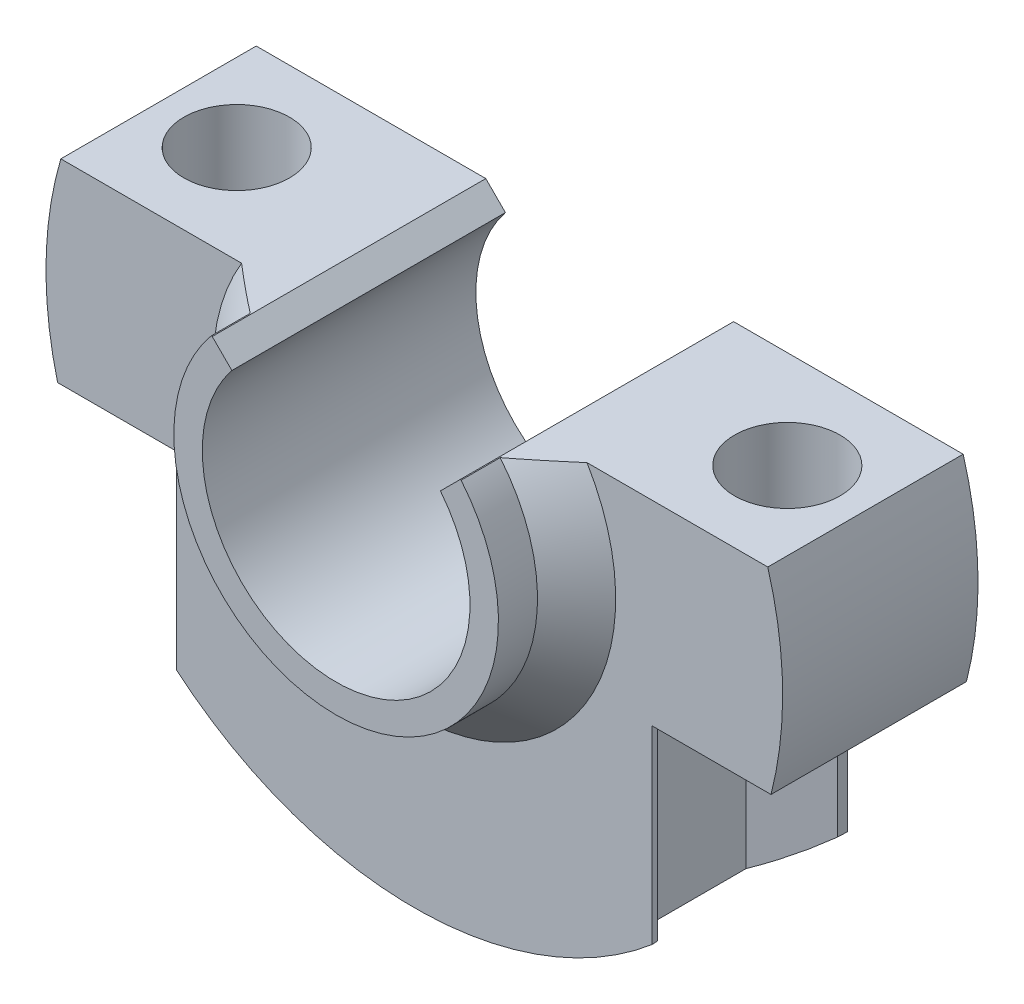
ISO-10303-21;
HEADER;
FILE_DESCRIPTION(('STEP AP214'),'2;1');
FILE_NAME('part.step','',(''),(''),'','','');
FILE_SCHEMA(('AUTOMOTIVE_DESIGN { 1 0 10303 214 1 1 1 1 }'));
ENDSEC;
DATA;
#1=APPLICATION_CONTEXT('core data for automotive mechanical design processes');
#2=APPLICATION_PROTOCOL_DEFINITION('international standard','automotive_design',2000,#1);
#3=PRODUCT_CONTEXT('',#1,'mechanical');
#4=PRODUCT('Part','Part','',(#3));
#5=PRODUCT_RELATED_PRODUCT_CATEGORY('part','',(#4));
#6=PRODUCT_DEFINITION_FORMATION('','',#4);
#7=PRODUCT_DEFINITION_CONTEXT('part definition',#1,'design');
#8=PRODUCT_DEFINITION('design','',#6,#7);
#9=PRODUCT_DEFINITION_SHAPE('','',#8);
#10=(LENGTH_UNIT() NAMED_UNIT(*) SI_UNIT(.MILLI.,.METRE.));
#11=(NAMED_UNIT(*) PLANE_ANGLE_UNIT() SI_UNIT($,.RADIAN.));
#12=(NAMED_UNIT(*) SI_UNIT($,.STERADIAN.) SOLID_ANGLE_UNIT());
#13=UNCERTAINTY_MEASURE_WITH_UNIT(LENGTH_MEASURE(1.E-05),#10,'distance_accuracy_value','');
#14=(GEOMETRIC_REPRESENTATION_CONTEXT(3) GLOBAL_UNCERTAINTY_ASSIGNED_CONTEXT((#13)) GLOBAL_UNIT_ASSIGNED_CONTEXT((#10,
#11,#12)) REPRESENTATION_CONTEXT('',''));
#15=CARTESIAN_POINT('',(0.,0.,0.));
#16=DIRECTION('',(0.,0.,1.));
#17=DIRECTION('',(1.,0.,0.));
#18=AXIS2_PLACEMENT_3D('',#15,#16,#17);
#19=CARTESIAN_POINT('',(0.,0.,2.5));
#20=DIRECTION('',(0.,0.,-1.));
#21=DIRECTION('',(-1.,0.,0.));
#22=AXIS2_PLACEMENT_3D('',#19,#20,#21);
#23=CYLINDRICAL_SURFACE('',#22,9.425);
#24=DIRECTION('',(0.,0.,-1.));
#25=VECTOR('',#24,1.);
#26=CARTESIAN_POINT('',(9.12723336786997,-2.35036934298441,2.5));
#27=LINE('',#26,#25);
#28=CARTESIAN_POINT('',(9.12723336786997,-2.35036934298441,-2.5));
#29=VERTEX_POINT('',#28);
#30=CARTESIAN_POINT('',(9.12723336786997,-2.35036934298441,2.5));
#31=VERTEX_POINT('',#30);
#32=EDGE_CURVE('E263',#29,#31,#27,.F.);
#33=ORIENTED_EDGE('',*,*,#32,.F.);
#34=CARTESIAN_POINT('',(0.,0.,-2.5));
#35=DIRECTION('',(0.,0.,1.));
#36=DIRECTION('',(1.,0.,0.));
#37=AXIS2_PLACEMENT_3D('',#34,#35,#36);
#38=CIRCLE('',#37,9.425);
#39=CARTESIAN_POINT('',(9.04489261303876,2.64963065701559,-2.5));
#40=VERTEX_POINT('',#39);
#41=EDGE_CURVE('E309',#29,#40,#38,.T.);
#42=ORIENTED_EDGE('',*,*,#41,.T.);
#43=DIRECTION('',(0.,0.,-1.));
#44=VECTOR('',#43,1.);
#45=CARTESIAN_POINT('',(9.04489261303876,2.64963065701559,2.5));
#46=LINE('',#45,#44);
#47=CARTESIAN_POINT('',(9.04489261303876,2.64963065701559,2.5));
#48=VERTEX_POINT('',#47);
#49=EDGE_CURVE('E307',#48,#40,#46,.T.);
#50=ORIENTED_EDGE('',*,*,#49,.F.);
#51=CARTESIAN_POINT('',(0.,0.,2.5));
#52=DIRECTION('',(0.,0.,1.));
#53=DIRECTION('',(1.,0.,0.));
#54=AXIS2_PLACEMENT_3D('',#51,#52,#53);
#55=CIRCLE('',#54,9.425);
#56=EDGE_CURVE('E299',#31,#48,#55,.T.);
#57=ORIENTED_EDGE('',*,*,#56,.F.);
#58=EDGE_LOOP('',(#33,#42,#50,#57));
#59=FACE_BOUND('',#58,.T.);
#60=ADVANCED_FACE('F47',(#59),#23,.T.);
#61=DIRECTION('',(0.,0.,-1.));
#62=VECTOR('',#61,1.);
#63=CARTESIAN_POINT('',(-9.12723336786997,-2.35036934298441,2.5));
#64=LINE('',#63,#62);
#65=CARTESIAN_POINT('',(-9.12723336786997,-2.35036934298441,2.5));
#66=VERTEX_POINT('',#65);
#67=CARTESIAN_POINT('',(-9.12723336786997,-2.35036934298441,-2.5));
#68=VERTEX_POINT('',#67);
#69=EDGE_CURVE('E256',#66,#68,#64,.T.);
#70=ORIENTED_EDGE('',*,*,#69,.F.);
#71=CARTESIAN_POINT('',(-9.04489261303876,2.64963065701559,2.5));
#72=VERTEX_POINT('',#71);
#73=EDGE_CURVE('E301',#72,#66,#55,.T.);
#74=ORIENTED_EDGE('',*,*,#73,.F.);
#75=DIRECTION('',(0.,0.,-1.));
#76=VECTOR('',#75,1.);
#77=CARTESIAN_POINT('',(-9.04489261303876,2.64963065701559,2.5));
#78=LINE('',#77,#76);
#79=CARTESIAN_POINT('',(-9.04489261303876,2.64963065701559,-2.5));
#80=VERTEX_POINT('',#79);
#81=EDGE_CURVE('E321',#72,#80,#78,.T.);
#82=ORIENTED_EDGE('',*,*,#81,.T.);
#83=EDGE_CURVE('E310',#80,#68,#38,.T.);
#84=ORIENTED_EDGE('',*,*,#83,.T.);
#85=EDGE_LOOP('',(#70,#74,#82,#84));
#86=FACE_BOUND('',#85,.T.);
#87=ADVANCED_FACE('F407',(#86),#23,.T.);
#88=CARTESIAN_POINT('',(7.04489261303876,2.64963065701559,0.));
#89=DIRECTION('',(0.,1.,0.));
#90=DIRECTION('',(0.,0.,1.));
#91=AXIS2_PLACEMENT_3D('',#88,#89,#90);
#92=CYLINDRICAL_SURFACE('',#91,1.34999999999999);
#93=CARTESIAN_POINT('',(7.04489261303876,2.64963065701559,0.));
#94=DIRECTION('',(0.,1.,0.));
#95=DIRECTION('',(0.,0.,1.));
#96=AXIS2_PLACEMENT_3D('',#93,#94,#95);
#97=CIRCLE('',#96,1.34999999999999);
#98=CARTESIAN_POINT('',(7.04489261303876,2.64963065701559,1.34999999999999));
#99=VERTEX_POINT('',#98);
#100=EDGE_CURVE('E279',#99,#99,#97,.T.);
#101=ORIENTED_EDGE('',*,*,#100,.T.);
#102=EDGE_LOOP('',(#101));
#103=FACE_BOUND('',#102,.T.);
#104=CARTESIAN_POINT('',(7.04489261303876,-2.35036934298441,0.));
#105=DIRECTION('',(0.,-1.,0.));
#106=DIRECTION('',(1.,0.,0.));
#107=AXIS2_PLACEMENT_3D('',#104,#105,#106);
#108=CIRCLE('',#107,1.34999999999999);
#109=CARTESIAN_POINT('',(8.39489261303875,-2.35036934298441,0.));
#110=VERTEX_POINT('',#109);
#111=EDGE_CURVE('E260',#110,#110,#108,.F.);
#112=ORIENTED_EDGE('',*,*,#111,.F.);
#113=EDGE_LOOP('',(#112));
#114=FACE_BOUND('',#113,.T.);
#115=ADVANCED_FACE('F465',(#103,#114),#92,.F.);
#116=CARTESIAN_POINT('',(-7.04489261303876,2.64963065701559,0.));
#117=DIRECTION('',(0.,1.,0.));
#118=DIRECTION('',(0.,0.,1.));
#119=AXIS2_PLACEMENT_3D('',#116,#117,#118);
#120=CYLINDRICAL_SURFACE('',#119,1.34999999999999);
#121=CARTESIAN_POINT('',(-7.04489261303876,2.64963065701559,0.));
#122=DIRECTION('',(0.,1.,0.));
#123=DIRECTION('',(0.,0.,1.));
#124=AXIS2_PLACEMENT_3D('',#121,#122,#123);
#125=CIRCLE('',#124,1.34999999999999);
#126=CARTESIAN_POINT('',(-7.04489261303876,2.64963065701559,1.34999999999999));
#127=VERTEX_POINT('',#126);
#128=EDGE_CURVE('E276',#127,#127,#125,.T.);
#129=ORIENTED_EDGE('',*,*,#128,.T.);
#130=EDGE_LOOP('',(#129));
#131=FACE_BOUND('',#130,.T.);
#132=CARTESIAN_POINT('',(-7.04489261303876,-2.35036934298441,0.));
#133=DIRECTION('',(0.,-1.,0.));
#134=DIRECTION('',(1.,0.,0.));
#135=AXIS2_PLACEMENT_3D('',#132,#133,#134);
#136=CIRCLE('',#135,1.34999999999999);
#137=CARTESIAN_POINT('',(-5.69489261303877,-2.35036934298441,0.));
#138=VERTEX_POINT('',#137);
#139=EDGE_CURVE('E235',#138,#138,#136,.F.);
#140=ORIENTED_EDGE('',*,*,#139,.F.);
#141=EDGE_LOOP('',(#140));
#142=FACE_BOUND('',#141,.T.);
#143=ADVANCED_FACE('F411',(#131,#142),#120,.F.);
#144=CARTESIAN_POINT('',(0.,2.64963065701559,2.5));
#145=DIRECTION('',(0.,-1.,0.));
#146=DIRECTION('',(1.,0.,0.));
#147=AXIS2_PLACEMENT_3D('',#144,#145,#146);
#148=PLANE('',#147);
#149=ORIENTED_EDGE('',*,*,#128,.F.);
#150=EDGE_LOOP('',(#149));
#151=FACE_BOUND('',#150,.T.);
#152=DIRECTION('',(-1.,0.,0.));
#153=VECTOR('',#152,1.);
#154=CARTESIAN_POINT('',(0.,2.64963065701559,4.5));
#155=LINE('',#154,#153);
#156=CARTESIAN_POINT('',(-3.17027242101151,2.64963065701559,4.5));
#157=VERTEX_POINT('',#156);
#158=CARTESIAN_POINT('',(-3.19781734803649,2.64963065701559,4.5));
#159=VERTEX_POINT('',#158);
#160=EDGE_CURVE('E282',#157,#159,#155,.T.);
#161=ORIENTED_EDGE('',*,*,#160,.F.);
#162=DIRECTION('',(0.,0.,-1.));
#163=VECTOR('',#162,1.);
#164=CARTESIAN_POINT('',(-3.17027242101151,2.64963065701559,-2.5));
#165=LINE('',#164,#163);
#166=CARTESIAN_POINT('',(-3.17027242101151,2.64963065701559,-2.5));
#167=VERTEX_POINT('',#166);
#168=EDGE_CURVE('E324',#157,#167,#165,.T.);
#169=ORIENTED_EDGE('',*,*,#168,.T.);
#170=DIRECTION('',(-1.,0.,0.));
#171=VECTOR('',#170,1.);
#172=CARTESIAN_POINT('',(0.,2.64963065701559,-2.5));
#173=LINE('',#172,#171);
#174=EDGE_CURVE('E296',#167,#80,#173,.T.);
#175=ORIENTED_EDGE('',*,*,#174,.T.);
#176=ORIENTED_EDGE('',*,*,#81,.F.);
#177=DIRECTION('',(-1.,0.,0.));
#178=VECTOR('',#177,1.);
#179=CARTESIAN_POINT('',(0.,2.64963065701559,2.5));
#180=LINE('',#179,#178);
#181=CARTESIAN_POINT('',(-4.41948365665076,2.64963065701559,2.5));
#182=VERTEX_POINT('',#181);
#183=EDGE_CURVE('E297',#182,#72,#180,.T.);
#184=ORIENTED_EDGE('',*,*,#183,.F.);
#185=CARTESIAN_POINT('',(-4.41948365665076,2.64963065701559,2.5));
#186=CARTESIAN_POINT('',(-4.31959768884231,2.64963065701559,2.58565684513443));
#187=CARTESIAN_POINT('',(-4.21934243178174,2.64963065701559,2.67088694132072));
#188=CARTESIAN_POINT('',(-4.01795020571289,2.64963065701559,2.84026347434788));
#189=CARTESIAN_POINT('',(-3.91681338856895,2.64963065701559,2.92441009188328));
#190=CARTESIAN_POINT('',(-3.71347592329484,2.64963065701559,3.09142298373748));
#191=CARTESIAN_POINT('',(-3.61127521962635,2.64963065701559,3.17428919064802));
#192=CARTESIAN_POINT('',(-3.40557353831562,2.64963065701559,3.33842619788159));
#193=CARTESIAN_POINT('',(-3.30207234305039,2.64963065701559,3.41969672519358));
#194=CARTESIAN_POINT('',(-3.19781734803649,2.64963065701559,3.50000000000001));
#195=B_SPLINE_CURVE_WITH_KNOTS('',3,(#185,#186,#187,#188,#189,#190,#191,#192,#193,#194),
.UNSPECIFIED.,.F.,.F.,(4,2,2,2,4),(0.,0.394753807508847,0.789440905232861,1.18414871126867,
1.57892347105236),.UNSPECIFIED.);
#196=CARTESIAN_POINT('',(-3.19781734803649,2.64963065701559,3.50000000000001));
#197=VERTEX_POINT('',#196);
#198=EDGE_CURVE('E12',#182,#197,#195,.T.);
#199=ORIENTED_EDGE('',*,*,#198,.T.);
#200=DIRECTION('',(0.,0.,-1.));
#201=VECTOR('',#200,1.);
#202=CARTESIAN_POINT('',(-3.19781734803649,2.64963065701559,4.5));
#203=LINE('',#202,#201);
#204=EDGE_CURVE('E293',#159,#197,#203,.T.);
#205=ORIENTED_EDGE('',*,*,#204,.F.);
#206=EDGE_LOOP('',(#161,#169,#175,#176,#184,#199,#205));
#207=FACE_BOUND('',#206,.T.);
#208=ADVANCED_FACE('F405',(#151,#207),#148,.F.);
#209=CARTESIAN_POINT('',(-6.08219930893342,-7.19982475942365,-2.5));
#210=VERTEX_POINT('',#209);
#211=CARTESIAN_POINT('',(6.0821993089334,-7.19982475942367,-2.5));
#212=VERTEX_POINT('',#211);
#213=EDGE_CURVE('E314',#210,#212,#38,.T.);
#214=ORIENTED_EDGE('',*,*,#213,.T.);
#215=CARTESIAN_POINT('',(0.,0.,20.1990768426996));
#216=DIRECTION('',(-0.965925826289068,0.,-0.258819045102522));
#217=DIRECTION('',(0.258819045102522,0.,-0.965925826289068));
#218=AXIS2_PLACEMENT_3D('',#215,#216,#217);
#219=ELLIPSE('',#218,36.4154036510976,9.425);
#220=CARTESIAN_POINT('',(6.02860947044718,-7.24475623142936,-2.3));
#221=VERTEX_POINT('',#220);
#222=EDGE_CURVE('E376',#212,#221,#219,.T.);
#223=ORIENTED_EDGE('',*,*,#222,.T.);
#224=CARTESIAN_POINT('',(0.,0.,1.1806193006018));
#225=DIRECTION('',(-0.5,0.,-0.866025403784439));
#226=DIRECTION('',(0.866025403784439,0.,-0.5));
#227=AXIS2_PLACEMENT_3D('',#224,#225,#226);
#228=ELLIPSE('',#227,10.8830525742244,9.425);
#229=CARTESIAN_POINT('',(4.54489261303876,-8.25678969914734,-1.44337567297407));
#230=VERTEX_POINT('',#229);
#231=EDGE_CURVE('E271',#221,#230,#228,.T.);
#232=ORIENTED_EDGE('',*,*,#231,.T.);
#233=DIRECTION('',(0.,0.,-1.));
#234=VECTOR('',#233,1.);
#235=CARTESIAN_POINT('',(4.54489261303876,-8.25678969914735,2.5));
#236=LINE('',#235,#234);
#237=CARTESIAN_POINT('',(4.54489261303876,-8.25678969914734,1.44337567297406));
#238=VERTEX_POINT('',#237);
#239=EDGE_CURVE('E348',#230,#238,#236,.F.);
#240=ORIENTED_EDGE('',*,*,#239,.T.);
#241=CARTESIAN_POINT('',(0.,0.,-1.1806193006018));
#242=DIRECTION('',(-0.5,0.,0.866025403784439));
#243=DIRECTION('',(-0.866025403784439,0.,-0.5));
#244=AXIS2_PLACEMENT_3D('',#241,#242,#243);
#245=ELLIPSE('',#244,10.8830525742244,9.425);
#246=CARTESIAN_POINT('',(6.02860947044718,-7.24475623142936,2.3));
#247=VERTEX_POINT('',#246);
#248=EDGE_CURVE('E228',#238,#247,#245,.T.);
#249=ORIENTED_EDGE('',*,*,#248,.T.);
#250=CARTESIAN_POINT('',(0.,0.,-20.1990768426996));
#251=DIRECTION('',(0.965925826289068,0.,-0.258819045102523));
#252=DIRECTION('',(-0.258819045102523,0.,-0.965925826289068));
#253=AXIS2_PLACEMENT_3D('',#250,#251,#252);
#254=ELLIPSE('',#253,36.4154036510976,9.425);
#255=CARTESIAN_POINT('',(6.08219930893341,-7.19982475942366,2.5));
#256=VERTEX_POINT('',#255);
#257=EDGE_CURVE('E358',#247,#256,#254,.F.);
#258=ORIENTED_EDGE('',*,*,#257,.T.);
#259=CARTESIAN_POINT('',(-6.0821993089334,-7.19982475942367,2.5));
#260=VERTEX_POINT('',#259);
#261=EDGE_CURVE('E305',#260,#256,#55,.T.);
#262=ORIENTED_EDGE('',*,*,#261,.F.);
#263=CARTESIAN_POINT('',(0.,0.,-20.1990768426992));
#264=DIRECTION('',(-0.965925826289067,0.,-0.258819045102526));
#265=DIRECTION('',(0.258819045102526,0.,-0.965925826289067));
#266=AXIS2_PLACEMENT_3D('',#263,#264,#265);
#267=ELLIPSE('',#266,36.4154036510971,9.425);
#268=CARTESIAN_POINT('',(-6.02860947044717,-7.24475623142937,2.3));
#269=VERTEX_POINT('',#268);
#270=EDGE_CURVE('E360',#260,#269,#267,.F.);
#271=ORIENTED_EDGE('',*,*,#270,.T.);
#272=CARTESIAN_POINT('',(0.,0.,-1.18061930060181));
#273=DIRECTION('',(0.5,0.,0.866025403784439));
#274=DIRECTION('',(0.866025403784439,0.,-0.5));
#275=AXIS2_PLACEMENT_3D('',#272,#273,#274);
#276=ELLIPSE('',#275,10.8830525742244,9.425);
#277=CARTESIAN_POINT('',(-4.54489261303876,-8.25678969914734,1.44337567297406));
#278=VERTEX_POINT('',#277);
#279=EDGE_CURVE('E273',#269,#278,#276,.T.);
#280=ORIENTED_EDGE('',*,*,#279,.T.);
#281=DIRECTION('',(0.,0.,-1.));
#282=VECTOR('',#281,1.);
#283=CARTESIAN_POINT('',(-4.54489261303876,-8.25678969914734,2.5));
#284=LINE('',#283,#282);
#285=CARTESIAN_POINT('',(-4.54489261303876,-8.25678969914734,-1.44337567297406));
#286=VERTEX_POINT('',#285);
#287=EDGE_CURVE('E342',#278,#286,#284,.T.);
#288=ORIENTED_EDGE('',*,*,#287,.T.);
#289=CARTESIAN_POINT('',(0.,0.,1.18061930060181));
#290=DIRECTION('',(0.5,0.,-0.866025403784439));
#291=DIRECTION('',(-0.866025403784439,0.,-0.5));
#292=AXIS2_PLACEMENT_3D('',#289,#290,#291);
#293=ELLIPSE('',#292,10.8830525742244,9.425);
#294=CARTESIAN_POINT('',(-6.02860947044719,-7.24475623142935,-2.30000000000001));
#295=VERTEX_POINT('',#294);
#296=EDGE_CURVE('E268',#286,#295,#293,.T.);
#297=ORIENTED_EDGE('',*,*,#296,.T.);
#298=CARTESIAN_POINT('',(0.,0.,20.1990768426992));
#299=DIRECTION('',(0.965925826289067,0.,-0.258819045102527));
#300=DIRECTION('',(-0.258819045102527,0.,-0.965925826289067));
#301=AXIS2_PLACEMENT_3D('',#298,#299,#300);
#302=ELLIPSE('',#301,36.415403651097,9.425);
#303=EDGE_CURVE('E374',#295,#210,#302,.T.);
#304=ORIENTED_EDGE('',*,*,#303,.T.);
#305=EDGE_LOOP('',(#214,#223,#232,#240,#249,#258,#262,#271,#280,#288,#297,#304));
#306=FACE_BOUND('',#305,.T.);
#307=ADVANCED_FACE('F401',(#306),#23,.T.);
#308=CARTESIAN_POINT('',(0.,2.64963065701559,2.5));
#309=DIRECTION('',(0.,1.,0.));
#310=DIRECTION('',(-1.,0.,0.));
#311=AXIS2_PLACEMENT_3D('',#308,#309,#310);
#312=PLANE('',#311);
#313=ORIENTED_EDGE('',*,*,#100,.F.);
#314=EDGE_LOOP('',(#313));
#315=FACE_BOUND('',#314,.T.);
#316=DIRECTION('',(1.,0.,0.));
#317=VECTOR('',#316,1.);
#318=CARTESIAN_POINT('',(0.,2.64963065701559,-2.5));
#319=LINE('',#318,#317);
#320=CARTESIAN_POINT('',(3.17027242101151,2.64963065701559,-2.5));
#321=VERTEX_POINT('',#320);
#322=EDGE_CURVE('E313',#321,#40,#319,.T.);
#323=ORIENTED_EDGE('',*,*,#322,.F.);
#324=DIRECTION('',(0.,0.,1.));
#325=VECTOR('',#324,1.);
#326=CARTESIAN_POINT('',(3.17027242101151,2.64963065701559,2.5));
#327=LINE('',#326,#325);
#328=CARTESIAN_POINT('',(3.17027242101151,2.64963065701559,4.5));
#329=VERTEX_POINT('',#328);
#330=EDGE_CURVE('E339',#321,#329,#327,.T.);
#331=ORIENTED_EDGE('',*,*,#330,.T.);
#332=DIRECTION('',(-1.,0.,0.));
#333=VECTOR('',#332,1.);
#334=CARTESIAN_POINT('',(0.,2.64963065701559,4.5));
#335=LINE('',#334,#333);
#336=CARTESIAN_POINT('',(3.19781734803649,2.64963065701559,4.5));
#337=VERTEX_POINT('',#336);
#338=EDGE_CURVE('E286',#337,#329,#335,.T.);
#339=ORIENTED_EDGE('',*,*,#338,.F.);
#340=DIRECTION('',(0.,0.,-1.));
#341=VECTOR('',#340,1.);
#342=CARTESIAN_POINT('',(3.19781734803649,2.64963065701559,4.5));
#343=LINE('',#342,#341);
#344=CARTESIAN_POINT('',(3.19781734803649,2.64963065701559,3.50000000000001));
#345=VERTEX_POINT('',#344);
#346=EDGE_CURVE('E291',#337,#345,#343,.T.);
#347=ORIENTED_EDGE('',*,*,#346,.T.);
#348=CARTESIAN_POINT('',(3.19781734803649,2.64963065701559,3.50000000000001));
#349=CARTESIAN_POINT('',(3.30207234305039,2.64963065701559,3.41969672519358));
#350=CARTESIAN_POINT('',(3.40557353831562,2.64963065701559,3.33842619788159));
#351=CARTESIAN_POINT('',(3.61127521962635,2.64963065701559,3.17428919064802));
#352=CARTESIAN_POINT('',(3.71347592329484,2.64963065701559,3.09142298373748));
#353=CARTESIAN_POINT('',(3.91681338856895,2.64963065701559,2.92441009188328));
#354=CARTESIAN_POINT('',(4.01795020571289,2.64963065701559,2.84026347434788));
#355=CARTESIAN_POINT('',(4.21934243178174,2.64963065701559,2.67088694132072));
#356=CARTESIAN_POINT('',(4.31959768884231,2.64963065701559,2.58565684513443));
#357=CARTESIAN_POINT('',(4.41948365665076,2.64963065701559,2.5));
#358=B_SPLINE_CURVE_WITH_KNOTS('',3,(#348,#349,#350,#351,#352,#353,#354,#355,#356,#357),
.UNSPECIFIED.,.F.,.F.,(4,2,2,2,4),(0.,0.394774759783691,0.789482565819501,1.18416966354351,
1.57892347105236),.UNSPECIFIED.);
#359=CARTESIAN_POINT('',(4.41948365665076,2.64963065701559,2.5));
#360=VERTEX_POINT('',#359);
#361=EDGE_CURVE('E62',#345,#360,#358,.T.);
#362=ORIENTED_EDGE('',*,*,#361,.T.);
#363=DIRECTION('',(1.,0.,0.));
#364=VECTOR('',#363,1.);
#365=CARTESIAN_POINT('',(0.,2.64963065701559,2.5));
#366=LINE('',#365,#364);
#367=EDGE_CURVE('E304',#360,#48,#366,.T.);
#368=ORIENTED_EDGE('',*,*,#367,.T.);
#369=ORIENTED_EDGE('',*,*,#49,.T.);
#370=EDGE_LOOP('',(#323,#331,#339,#347,#362,#368,#369));
#371=FACE_BOUND('',#370,.T.);
#372=ADVANCED_FACE('F395',(#315,#371),#312,.T.);
#373=CARTESIAN_POINT('',(0.,0.,2.5));
#374=DIRECTION('',(0.,0.,-1.));
#375=DIRECTION('',(-1.,0.,0.));
#376=AXIS2_PLACEMENT_3D('',#373,#374,#375);
#377=CYLINDRICAL_SURFACE('',#376,3.425);
#378=CARTESIAN_POINT('',(0.,0.,4.5));
#379=DIRECTION('',(0.,0.,1.));
#380=DIRECTION('',(1.,0.,0.));
#381=AXIS2_PLACEMENT_3D('',#378,#379,#380);
#382=CIRCLE('',#381,3.425);
#383=CARTESIAN_POINT('',(2.66813016397936,2.14748839998345,4.5));
#384=VERTEX_POINT('',#383);
#385=CARTESIAN_POINT('',(-2.66813016397936,2.14748839998345,4.5));
#386=VERTEX_POINT('',#385);
#387=EDGE_CURVE('E289',#384,#386,#382,.F.);
#388=ORIENTED_EDGE('',*,*,#387,.F.);
#389=DIRECTION('',(0.,0.,-1.));
#390=VECTOR('',#389,1.);
#391=CARTESIAN_POINT('',(2.66813016397936,2.14748839998345,2.5));
#392=LINE('',#391,#390);
#393=CARTESIAN_POINT('',(2.66813016397936,2.14748839998345,-2.5));
#394=VERTEX_POINT('',#393);
#395=EDGE_CURVE('E334',#384,#394,#392,.T.);
#396=ORIENTED_EDGE('',*,*,#395,.T.);
#397=CARTESIAN_POINT('',(0.,0.,-2.5));
#398=DIRECTION('',(0.,0.,1.));
#399=DIRECTION('',(1.,0.,0.));
#400=AXIS2_PLACEMENT_3D('',#397,#398,#399);
#401=CIRCLE('',#400,3.425);
#402=CARTESIAN_POINT('',(-2.66813016397936,2.14748839998345,-2.5));
#403=VERTEX_POINT('',#402);
#404=EDGE_CURVE('E300',#403,#394,#401,.T.);
#405=ORIENTED_EDGE('',*,*,#404,.F.);
#406=DIRECTION('',(0.,0.,-1.));
#407=VECTOR('',#406,1.);
#408=CARTESIAN_POINT('',(-2.66813016397936,2.14748839998345,2.5));
#409=LINE('',#408,#407);
#410=EDGE_CURVE('E329',#403,#386,#409,.F.);
#411=ORIENTED_EDGE('',*,*,#410,.T.);
#412=EDGE_LOOP('',(#388,#396,#405,#411));
#413=FACE_BOUND('',#412,.T.);
#414=ADVANCED_FACE('F400',(#413),#377,.F.);
#415=CARTESIAN_POINT('',(0.,0.,2.5));
#416=DIRECTION('',(0.,0.,1.));
#417=DIRECTION('',(1.,0.,0.));
#418=AXIS2_PLACEMENT_3D('',#415,#416,#417);
#419=PLANE('',#418);
#420=ORIENTED_EDGE('',*,*,#367,.F.);
#421=CARTESIAN_POINT('',(0.,0.,2.5));
#422=DIRECTION('',(0.,0.,1.));
#423=DIRECTION('',(1.,0.,0.));
#424=AXIS2_PLACEMENT_3D('',#421,#422,#423);
#425=CIRCLE('',#424,5.1529);
#426=EDGE_CURVE('E69',#360,#182,#425,.F.);
#427=ORIENTED_EDGE('',*,*,#426,.T.);
#428=ORIENTED_EDGE('',*,*,#183,.T.);
#429=ORIENTED_EDGE('',*,*,#73,.T.);
#430=DIRECTION('',(1.,0.,0.));
#431=VECTOR('',#430,1.);
#432=CARTESIAN_POINT('',(0.,-2.35036934298441,2.5));
#433=LINE('',#432,#431);
#434=CARTESIAN_POINT('',(-6.0821993089334,-2.35036934298441,2.5));
#435=VERTEX_POINT('',#434);
#436=EDGE_CURVE('E258',#66,#435,#433,.T.);
#437=ORIENTED_EDGE('',*,*,#436,.T.);
#438=DIRECTION('',(0.,-1.,0.));
#439=VECTOR('',#438,1.);
#440=CARTESIAN_POINT('',(-6.0821993089334,-6.94188372793094,2.5));
#441=LINE('',#440,#439);
#442=EDGE_CURVE('E356',#435,#260,#441,.T.);
#443=ORIENTED_EDGE('',*,*,#442,.T.);
#444=ORIENTED_EDGE('',*,*,#261,.T.);
#445=DIRECTION('',(0.,1.,0.));
#446=VECTOR('',#445,1.);
#447=CARTESIAN_POINT('',(6.08219930893341,-2.35036934298441,2.5));
#448=LINE('',#447,#446);
#449=CARTESIAN_POINT('',(6.08219930893341,-2.35036934298441,2.5));
#450=VERTEX_POINT('',#449);
#451=EDGE_CURVE('E353',#256,#450,#448,.T.);
#452=ORIENTED_EDGE('',*,*,#451,.T.);
#453=DIRECTION('',(1.,0.,0.));
#454=VECTOR('',#453,1.);
#455=CARTESIAN_POINT('',(0.,-2.35036934298441,2.5));
#456=LINE('',#455,#454);
#457=EDGE_CURVE('E265',#450,#31,#456,.T.);
#458=ORIENTED_EDGE('',*,*,#457,.T.);
#459=ORIENTED_EDGE('',*,*,#56,.T.);
#460=EDGE_LOOP('',(#420,#427,#428,#429,#437,#443,#444,#452,#458,#459));
#461=FACE_BOUND('',#460,.T.);
#462=ADVANCED_FACE('F506',(#461),#419,.T.);
#463=CARTESIAN_POINT('',(0.,0.,-2.5));
#464=DIRECTION('',(0.,0.,1.));
#465=DIRECTION('',(1.,0.,0.));
#466=AXIS2_PLACEMENT_3D('',#463,#464,#465);
#467=PLANE('',#466);
#468=DIRECTION('',(1.,0.,0.));
#469=VECTOR('',#468,1.);
#470=CARTESIAN_POINT('',(0.,-2.35036934298441,-2.5));
#471=LINE('',#470,#469);
#472=CARTESIAN_POINT('',(6.0821993089334,-2.35036934298441,-2.5));
#473=VERTEX_POINT('',#472);
#474=EDGE_CURVE('E261',#473,#29,#471,.T.);
#475=ORIENTED_EDGE('',*,*,#474,.F.);
#476=DIRECTION('',(0.,-1.,0.));
#477=VECTOR('',#476,1.);
#478=CARTESIAN_POINT('',(6.0821993089334,0.,-2.5));
#479=LINE('',#478,#477);
#480=EDGE_CURVE('E371',#473,#212,#479,.T.);
#481=ORIENTED_EDGE('',*,*,#480,.T.);
#482=ORIENTED_EDGE('',*,*,#213,.F.);
#483=DIRECTION('',(0.,1.,0.));
#484=VECTOR('',#483,1.);
#485=CARTESIAN_POINT('',(-6.08219930893342,0.,-2.5));
#486=LINE('',#485,#484);
#487=CARTESIAN_POINT('',(-6.08219930893342,-2.35036934298441,-2.5));
#488=VERTEX_POINT('',#487);
#489=EDGE_CURVE('E368',#210,#488,#486,.T.);
#490=ORIENTED_EDGE('',*,*,#489,.T.);
#491=DIRECTION('',(1.,0.,0.));
#492=VECTOR('',#491,1.);
#493=CARTESIAN_POINT('',(0.,-2.35036934298441,-2.5));
#494=LINE('',#493,#492);
#495=EDGE_CURVE('E238',#68,#488,#494,.T.);
#496=ORIENTED_EDGE('',*,*,#495,.F.);
#497=ORIENTED_EDGE('',*,*,#83,.F.);
#498=ORIENTED_EDGE('',*,*,#174,.F.);
#499=DIRECTION('',(-0.707106781186553,0.707106781186542,0.));
#500=VECTOR('',#499,1.);
#501=CARTESIAN_POINT('',(-3.17027242101151,2.64963065701559,-2.5));
#502=LINE('',#501,#500);
#503=EDGE_CURVE('E327',#167,#403,#502,.F.);
#504=ORIENTED_EDGE('',*,*,#503,.T.);
#505=ORIENTED_EDGE('',*,*,#404,.T.);
#506=DIRECTION('',(-0.707106781186551,-0.707106781186544,0.));
#507=VECTOR('',#506,1.);
#508=CARTESIAN_POINT('',(2.66813016397936,2.14748839998345,-2.5));
#509=LINE('',#508,#507);
#510=EDGE_CURVE('E337',#394,#321,#509,.F.);
#511=ORIENTED_EDGE('',*,*,#510,.T.);
#512=ORIENTED_EDGE('',*,*,#322,.T.);
#513=ORIENTED_EDGE('',*,*,#41,.F.);
#514=EDGE_LOOP('',(#475,#481,#482,#490,#496,#497,#498,#504,#505,#511,#512,#513));
#515=FACE_BOUND('',#514,.T.);
#516=ADVANCED_FACE('F473',(#515),#467,.F.);
#517=CARTESIAN_POINT('',(0.,0.,4.5));
#518=DIRECTION('',(0.,0.,-1.));
#519=DIRECTION('',(-1.,0.,0.));
#520=AXIS2_PLACEMENT_3D('',#517,#518,#519);
#521=CYLINDRICAL_SURFACE('',#520,4.1529);
#522=ORIENTED_EDGE('',*,*,#204,.T.);
#523=CARTESIAN_POINT('',(0.,0.,3.50000000000001));
#524=DIRECTION('',(0.,0.,1.));
#525=DIRECTION('',(1.,0.,0.));
#526=AXIS2_PLACEMENT_3D('',#523,#524,#525);
#527=CIRCLE('',#526,4.1529);
#528=EDGE_CURVE('E387',#197,#345,#527,.T.);
#529=ORIENTED_EDGE('',*,*,#528,.T.);
#530=ORIENTED_EDGE('',*,*,#346,.F.);
#531=CARTESIAN_POINT('',(0.,0.,4.5));
#532=DIRECTION('',(0.,0.,1.));
#533=DIRECTION('',(1.,0.,0.));
#534=AXIS2_PLACEMENT_3D('',#531,#532,#533);
#535=CIRCLE('',#534,4.1529);
#536=EDGE_CURVE('E284',#159,#337,#535,.T.);
#537=ORIENTED_EDGE('',*,*,#536,.F.);
#538=EDGE_LOOP('',(#522,#529,#530,#537));
#539=FACE_BOUND('',#538,.T.);
#540=ADVANCED_FACE('F514',(#539),#521,.T.);
#541=CARTESIAN_POINT('',(0.,0.,4.5));
#542=DIRECTION('',(0.,0.,1.));
#543=DIRECTION('',(1.,0.,0.));
#544=AXIS2_PLACEMENT_3D('',#541,#542,#543);
#545=PLANE('',#544);
#546=ORIENTED_EDGE('',*,*,#338,.T.);
#547=DIRECTION('',(0.707106781186551,0.707106781186544,0.));
#548=VECTOR('',#547,1.);
#549=CARTESIAN_POINT('',(0.260320881997943,-0.260320881997946,4.5));
#550=LINE('',#549,#548);
#551=EDGE_CURVE('E341',#329,#384,#550,.F.);
#552=ORIENTED_EDGE('',*,*,#551,.T.);
#553=ORIENTED_EDGE('',*,*,#387,.T.);
#554=DIRECTION('',(0.707106781186553,-0.707106781186542,0.));
#555=VECTOR('',#554,1.);
#556=CARTESIAN_POINT('',(-0.260320881997936,-0.26032088199794,4.5));
#557=LINE('',#556,#555);
#558=EDGE_CURVE('E332',#386,#157,#557,.F.);
#559=ORIENTED_EDGE('',*,*,#558,.T.);
#560=ORIENTED_EDGE('',*,*,#160,.T.);
#561=ORIENTED_EDGE('',*,*,#536,.T.);
#562=EDGE_LOOP('',(#546,#552,#553,#559,#560,#561));
#563=FACE_BOUND('',#562,.T.);
#564=ADVANCED_FACE('F421',(#563),#545,.T.);
#565=CARTESIAN_POINT('',(-3.17027242101151,2.64963065701559,2.5));
#566=DIRECTION('',(-0.707106781186542,-0.707106781186553,0.));
#567=DIRECTION('',(0.,0.,-1.));
#568=AXIS2_PLACEMENT_3D('',#565,#566,#567);
#569=PLANE('',#568);
#570=ORIENTED_EDGE('',*,*,#558,.F.);
#571=ORIENTED_EDGE('',*,*,#410,.F.);
#572=ORIENTED_EDGE('',*,*,#503,.F.);
#573=ORIENTED_EDGE('',*,*,#168,.F.);
#574=EDGE_LOOP('',(#570,#571,#572,#573));
#575=FACE_BOUND('',#574,.T.);
#576=ADVANCED_FACE('F414',(#575),#569,.F.);
#577=CARTESIAN_POINT('',(2.66813016397936,2.14748839998345,2.5));
#578=DIRECTION('',(0.707106781186544,-0.707106781186551,0.));
#579=DIRECTION('',(0.,0.,-1.));
#580=AXIS2_PLACEMENT_3D('',#577,#578,#579);
#581=PLANE('',#580);
#582=ORIENTED_EDGE('',*,*,#551,.F.);
#583=ORIENTED_EDGE('',*,*,#330,.F.);
#584=ORIENTED_EDGE('',*,*,#510,.F.);
#585=ORIENTED_EDGE('',*,*,#395,.F.);
#586=EDGE_LOOP('',(#582,#583,#584,#585));
#587=FACE_BOUND('',#586,.T.);
#588=ADVANCED_FACE('F420',(#587),#581,.F.);
#589=CARTESIAN_POINT('',(-4.54489261303876,12.114477900016,0.));
#590=DIRECTION('',(1.,0.,0.));
#591=DIRECTION('',(0.,1.,0.));
#592=AXIS2_PLACEMENT_3D('',#589,#590,#591);
#593=PLANE('',#592);
#594=DIRECTION('',(0.,-1.,0.));
#595=VECTOR('',#594,1.);
#596=CARTESIAN_POINT('',(-4.54489261303876,12.114477900016,1.44337567297406));
#597=LINE('',#596,#595);
#598=CARTESIAN_POINT('',(-4.54489261303876,-2.35036934298441,1.44337567297406));
#599=VERTEX_POINT('',#598);
#600=EDGE_CURVE('E247',#599,#278,#597,.T.);
#601=ORIENTED_EDGE('',*,*,#600,.F.);
#602=DIRECTION('',(0.,0.,-1.));
#603=VECTOR('',#602,1.);
#604=CARTESIAN_POINT('',(-4.54489261303876,-2.35036934298441,0.));
#605=LINE('',#604,#603);
#606=CARTESIAN_POINT('',(-4.54489261303876,-2.35036934298441,-1.44337567297406));
#607=VERTEX_POINT('',#606);
#608=EDGE_CURVE('E246',#599,#607,#605,.T.);
#609=ORIENTED_EDGE('',*,*,#608,.T.);
#610=DIRECTION('',(0.,-1.,0.));
#611=VECTOR('',#610,1.);
#612=CARTESIAN_POINT('',(-4.54489261303876,12.114477900016,-1.44337567297406));
#613=LINE('',#612,#611);
#614=EDGE_CURVE('E252',#607,#286,#613,.T.);
#615=ORIENTED_EDGE('',*,*,#614,.T.);
#616=ORIENTED_EDGE('',*,*,#287,.F.);
#617=EDGE_LOOP('',(#601,#609,#615,#616));
#618=FACE_BOUND('',#617,.T.);
#619=ADVANCED_FACE('F428',(#618),#593,.F.);
#620=CARTESIAN_POINT('',(-0.511223153259691,12.114477900016,-0.885464475451355));
#621=DIRECTION('',(0.5,0.,0.866025403784439));
#622=DIRECTION('',(0.866025403784439,0.,-0.5));
#623=AXIS2_PLACEMENT_3D('',#620,#621,#622);
#624=PLANE('',#623);
#625=ORIENTED_EDGE('',*,*,#279,.F.);
#626=DIRECTION('',(0.,1.,0.));
#627=VECTOR('',#626,1.);
#628=CARTESIAN_POINT('',(-6.02860947044718,-2.35036934298441,2.3));
#629=LINE('',#628,#627);
#630=CARTESIAN_POINT('',(-6.02860947044718,-2.35036934298441,2.3));
#631=VERTEX_POINT('',#630);
#632=EDGE_CURVE('E350',#269,#631,#629,.T.);
#633=ORIENTED_EDGE('',*,*,#632,.T.);
#634=DIRECTION('',(0.866025403784439,0.,-0.5));
#635=VECTOR('',#634,1.);
#636=CARTESIAN_POINT('',(-0.51122315325969,-2.35036934298441,-0.885464475451355));
#637=LINE('',#636,#635);
#638=EDGE_CURVE('E229',#631,#599,#637,.T.);
#639=ORIENTED_EDGE('',*,*,#638,.T.);
#640=ORIENTED_EDGE('',*,*,#600,.T.);
#641=EDGE_LOOP('',(#625,#633,#639,#640));
#642=FACE_BOUND('',#641,.T.);
#643=ADVANCED_FACE('F499',(#642),#624,.F.);
#644=CARTESIAN_POINT('',(-0.511223153259691,12.114477900016,0.885464475451355));
#645=DIRECTION('',(0.5,0.,-0.866025403784439));
#646=DIRECTION('',(-0.866025403784439,0.,-0.5));
#647=AXIS2_PLACEMENT_3D('',#644,#645,#646);
#648=PLANE('',#647);
#649=DIRECTION('',(-0.866025403784439,0.,-0.5));
#650=VECTOR('',#649,1.);
#651=CARTESIAN_POINT('',(-0.51122315325969,-2.35036934298441,0.885464475451355));
#652=LINE('',#651,#650);
#653=CARTESIAN_POINT('',(-6.02860947044719,-2.35036934298441,-2.30000000000001));
#654=VERTEX_POINT('',#653);
#655=EDGE_CURVE('E243',#607,#654,#652,.T.);
#656=ORIENTED_EDGE('',*,*,#655,.T.);
#657=DIRECTION('',(0.,-1.,0.));
#658=VECTOR('',#657,1.);
#659=CARTESIAN_POINT('',(-6.02860947044719,12.114477900016,-2.3));
#660=LINE('',#659,#658);
#661=EDGE_CURVE('E380',#654,#295,#660,.T.);
#662=ORIENTED_EDGE('',*,*,#661,.T.);
#663=ORIENTED_EDGE('',*,*,#296,.F.);
#664=ORIENTED_EDGE('',*,*,#614,.F.);
#665=EDGE_LOOP('',(#656,#662,#663,#664));
#666=FACE_BOUND('',#665,.T.);
#667=ADVANCED_FACE('F490',(#666),#648,.F.);
#668=CARTESIAN_POINT('',(0.,-2.35036934298441,2.5));
#669=DIRECTION('',(0.,-1.,0.));
#670=DIRECTION('',(1.,0.,0.));
#671=AXIS2_PLACEMENT_3D('',#668,#669,#670);
#672=PLANE('',#671);
#673=ORIENTED_EDGE('',*,*,#69,.T.);
#674=ORIENTED_EDGE('',*,*,#495,.T.);
#675=DIRECTION('',(-0.258819045102527,0.,-0.965925826289067));
#676=VECTOR('',#675,1.);
#677=CARTESIAN_POINT('',(-6.08219930893342,-2.35036934298441,-2.5));
#678=LINE('',#677,#676);
#679=EDGE_CURVE('E385',#488,#654,#678,.F.);
#680=ORIENTED_EDGE('',*,*,#679,.T.);
#681=ORIENTED_EDGE('',*,*,#655,.F.);
#682=ORIENTED_EDGE('',*,*,#608,.F.);
#683=ORIENTED_EDGE('',*,*,#638,.F.);
#684=DIRECTION('',(-0.258819045102526,0.,0.965925826289067));
#685=VECTOR('',#684,1.);
#686=CARTESIAN_POINT('',(-6.02860947044718,-2.35036934298441,2.3));
#687=LINE('',#686,#685);
#688=EDGE_CURVE('E364',#631,#435,#687,.T.);
#689=ORIENTED_EDGE('',*,*,#688,.T.);
#690=ORIENTED_EDGE('',*,*,#436,.F.);
#691=EDGE_LOOP('',(#673,#674,#680,#681,#682,#683,#689,#690));
#692=FACE_BOUND('',#691,.T.);
#693=ORIENTED_EDGE('',*,*,#139,.T.);
#694=EDGE_LOOP('',(#693));
#695=FACE_BOUND('',#694,.T.);
#696=ADVANCED_FACE('F485',(#692,#695),#672,.T.);
#697=CARTESIAN_POINT('',(4.54489261303876,12.114477900016,0.));
#698=DIRECTION('',(-1.,0.,0.));
#699=DIRECTION('',(0.,0.,1.));
#700=AXIS2_PLACEMENT_3D('',#697,#698,#699);
#701=PLANE('',#700);
#702=DIRECTION('',(0.,-1.,0.));
#703=VECTOR('',#702,1.);
#704=CARTESIAN_POINT('',(4.54489261303876,12.114477900016,-1.44337567297407));
#705=LINE('',#704,#703);
#706=CARTESIAN_POINT('',(4.54489261303876,-2.35036934298441,-1.44337567297407));
#707=VERTEX_POINT('',#706);
#708=EDGE_CURVE('E215',#707,#230,#705,.T.);
#709=ORIENTED_EDGE('',*,*,#708,.F.);
#710=DIRECTION('',(0.,0.,1.));
#711=VECTOR('',#710,1.);
#712=CARTESIAN_POINT('',(4.54489261303876,-2.35036934298441,0.));
#713=LINE('',#712,#711);
#714=CARTESIAN_POINT('',(4.54489261303876,-2.35036934298441,1.44337567297406));
#715=VERTEX_POINT('',#714);
#716=EDGE_CURVE('E208',#707,#715,#713,.T.);
#717=ORIENTED_EDGE('',*,*,#716,.T.);
#718=DIRECTION('',(0.,-1.,0.));
#719=VECTOR('',#718,1.);
#720=CARTESIAN_POINT('',(4.54489261303876,12.114477900016,1.44337567297406));
#721=LINE('',#720,#719);
#722=EDGE_CURVE('E212',#715,#238,#721,.T.);
#723=ORIENTED_EDGE('',*,*,#722,.T.);
#724=ORIENTED_EDGE('',*,*,#239,.F.);
#725=EDGE_LOOP('',(#709,#717,#723,#724));
#726=FACE_BOUND('',#725,.T.);
#727=ADVANCED_FACE('F210',(#726),#701,.F.);
#728=CARTESIAN_POINT('',(0.511223153259688,12.114477900016,-0.885464475451352));
#729=DIRECTION('',(-0.5,0.,0.866025403784439));
#730=DIRECTION('',(0.866025403784439,0.,0.5));
#731=AXIS2_PLACEMENT_3D('',#728,#729,#730);
#732=PLANE('',#731);
#733=DIRECTION('',(0.866025403784439,0.,0.5));
#734=VECTOR('',#733,1.);
#735=CARTESIAN_POINT('',(0.511223153259689,-2.35036934298441,-0.885464475451352));
#736=LINE('',#735,#734);
#737=CARTESIAN_POINT('',(6.02860947044718,-2.35036934298441,2.3));
#738=VERTEX_POINT('',#737);
#739=EDGE_CURVE('E225',#715,#738,#736,.T.);
#740=ORIENTED_EDGE('',*,*,#739,.T.);
#741=DIRECTION('',(0.,-1.,0.));
#742=VECTOR('',#741,1.);
#743=CARTESIAN_POINT('',(6.02860947044718,-6.94188372793094,2.30000000000001));
#744=LINE('',#743,#742);
#745=EDGE_CURVE('E362',#738,#247,#744,.T.);
#746=ORIENTED_EDGE('',*,*,#745,.T.);
#747=ORIENTED_EDGE('',*,*,#248,.F.);
#748=ORIENTED_EDGE('',*,*,#722,.F.);
#749=EDGE_LOOP('',(#740,#746,#747,#748));
#750=FACE_BOUND('',#749,.T.);
#751=ADVANCED_FACE('F223',(#750),#732,.F.);
#752=CARTESIAN_POINT('',(0.511223153259688,12.114477900016,0.885464475451352));
#753=DIRECTION('',(-0.5,0.,-0.866025403784439));
#754=DIRECTION('',(-0.866025403784439,0.,0.5));
#755=AXIS2_PLACEMENT_3D('',#752,#753,#754);
#756=PLANE('',#755);
#757=ORIENTED_EDGE('',*,*,#231,.F.);
#758=DIRECTION('',(0.,1.,0.));
#759=VECTOR('',#758,1.);
#760=CARTESIAN_POINT('',(6.02860947044718,12.114477900016,-2.3));
#761=LINE('',#760,#759);
#762=CARTESIAN_POINT('',(6.02860947044718,-2.35036934298441,-2.3));
#763=VERTEX_POINT('',#762);
#764=EDGE_CURVE('E378',#221,#763,#761,.T.);
#765=ORIENTED_EDGE('',*,*,#764,.T.);
#766=DIRECTION('',(-0.866025403784439,0.,0.5));
#767=VECTOR('',#766,1.);
#768=CARTESIAN_POINT('',(0.511223153259689,-2.35036934298441,0.885464475451352));
#769=LINE('',#768,#767);
#770=EDGE_CURVE('E219',#763,#707,#769,.T.);
#771=ORIENTED_EDGE('',*,*,#770,.T.);
#772=ORIENTED_EDGE('',*,*,#708,.T.);
#773=EDGE_LOOP('',(#757,#765,#771,#772));
#774=FACE_BOUND('',#773,.T.);
#775=ADVANCED_FACE('F531',(#774),#756,.F.);
#776=CARTESIAN_POINT('',(0.,-2.35036934298441,2.5));
#777=DIRECTION('',(0.,-1.,0.));
#778=DIRECTION('',(1.,0.,0.));
#779=AXIS2_PLACEMENT_3D('',#776,#777,#778);
#780=PLANE('',#779);
#781=ORIENTED_EDGE('',*,*,#739,.F.);
#782=ORIENTED_EDGE('',*,*,#716,.F.);
#783=ORIENTED_EDGE('',*,*,#770,.F.);
#784=DIRECTION('',(-0.258819045102522,0.,0.965925826289068));
#785=VECTOR('',#784,1.);
#786=CARTESIAN_POINT('',(6.0821993089334,-2.35036934298441,-2.5));
#787=LINE('',#786,#785);
#788=EDGE_CURVE('E382',#763,#473,#787,.F.);
#789=ORIENTED_EDGE('',*,*,#788,.T.);
#790=ORIENTED_EDGE('',*,*,#474,.T.);
#791=ORIENTED_EDGE('',*,*,#32,.T.);
#792=ORIENTED_EDGE('',*,*,#457,.F.);
#793=DIRECTION('',(-0.258819045102523,0.,-0.965925826289068));
#794=VECTOR('',#793,1.);
#795=CARTESIAN_POINT('',(6.02860947044718,-2.35036934298441,2.3));
#796=LINE('',#795,#794);
#797=EDGE_CURVE('E234',#450,#738,#796,.T.);
#798=ORIENTED_EDGE('',*,*,#797,.T.);
#799=EDGE_LOOP('',(#781,#782,#783,#789,#790,#791,#792,#798));
#800=FACE_BOUND('',#799,.T.);
#801=ORIENTED_EDGE('',*,*,#111,.T.);
#802=EDGE_LOOP('',(#801));
#803=FACE_BOUND('',#802,.T.);
#804=ADVANCED_FACE('F231',(#800,#803),#780,.T.);
#805=CARTESIAN_POINT('',(-6.02860947044718,12.114477900016,2.3));
#806=DIRECTION('',(-0.965925826289067,0.,-0.258819045102526));
#807=DIRECTION('',(0.,-1.,0.));
#808=AXIS2_PLACEMENT_3D('',#805,#806,#807);
#809=PLANE('',#808);
#810=ORIENTED_EDGE('',*,*,#270,.F.);
#811=ORIENTED_EDGE('',*,*,#442,.F.);
#812=ORIENTED_EDGE('',*,*,#688,.F.);
#813=ORIENTED_EDGE('',*,*,#632,.F.);
#814=EDGE_LOOP('',(#810,#811,#812,#813));
#815=FACE_BOUND('',#814,.T.);
#816=ADVANCED_FACE('F430',(#815),#809,.T.);
#817=CARTESIAN_POINT('',(6.02860947044718,12.114477900016,2.3));
#818=DIRECTION('',(0.965925826289068,0.,-0.258819045102523));
#819=DIRECTION('',(0.,1.,0.));
#820=AXIS2_PLACEMENT_3D('',#817,#818,#819);
#821=PLANE('',#820);
#822=ORIENTED_EDGE('',*,*,#797,.F.);
#823=ORIENTED_EDGE('',*,*,#451,.F.);
#824=ORIENTED_EDGE('',*,*,#257,.F.);
#825=ORIENTED_EDGE('',*,*,#745,.F.);
#826=EDGE_LOOP('',(#822,#823,#824,#825));
#827=FACE_BOUND('',#826,.T.);
#828=ADVANCED_FACE('F436',(#827),#821,.T.);
#829=CARTESIAN_POINT('',(6.0821993089334,0.,-2.5));
#830=DIRECTION('',(-0.965925826289068,0.,-0.258819045102522));
#831=DIRECTION('',(0.,-1.,0.));
#832=AXIS2_PLACEMENT_3D('',#829,#830,#831);
#833=PLANE('',#832);
#834=ORIENTED_EDGE('',*,*,#788,.F.);
#835=ORIENTED_EDGE('',*,*,#764,.F.);
#836=ORIENTED_EDGE('',*,*,#222,.F.);
#837=ORIENTED_EDGE('',*,*,#480,.F.);
#838=EDGE_LOOP('',(#834,#835,#836,#837));
#839=FACE_BOUND('',#838,.T.);
#840=ADVANCED_FACE('F443',(#839),#833,.F.);
#841=CARTESIAN_POINT('',(-6.08219930893342,0.,-2.5));
#842=DIRECTION('',(0.965925826289067,0.,-0.258819045102527));
#843=DIRECTION('',(0.,1.,0.));
#844=AXIS2_PLACEMENT_3D('',#841,#842,#843);
#845=PLANE('',#844);
#846=ORIENTED_EDGE('',*,*,#303,.F.);
#847=ORIENTED_EDGE('',*,*,#661,.F.);
#848=ORIENTED_EDGE('',*,*,#679,.F.);
#849=ORIENTED_EDGE('',*,*,#489,.F.);
#850=EDGE_LOOP('',(#846,#847,#848,#849));
#851=FACE_BOUND('',#850,.T.);
#852=ADVANCED_FACE('F449',(#851),#845,.F.);
#853=CARTESIAN_POINT('',(0.,0.,3.50000000000001));
#854=DIRECTION('',(0.,0.,-1.));
#855=DIRECTION('',(-1.,0.,0.));
#856=AXIS2_PLACEMENT_3D('',#853,#854,#855);
#857=CONICAL_SURFACE('',#856,4.1529,0.785398163397444);
#858=ORIENTED_EDGE('',*,*,#198,.F.);
#859=ORIENTED_EDGE('',*,*,#426,.F.);
#860=ORIENTED_EDGE('',*,*,#361,.F.);
#861=ORIENTED_EDGE('',*,*,#528,.F.);
#862=EDGE_LOOP('',(#858,#859,#860,#861));
#863=FACE_BOUND('',#862,.T.);
#864=ADVANCED_FACE('F50',(#863),#857,.T.);
#865=CLOSED_SHELL('',(#60,#87,#115,#143,#208,#307,#372,#414,#462,#516,#540,#564,#576,#588,#619,
#643,#667,#696,#727,#751,#775,#804,#816,#828,#840,#852,#864));
#866=MANIFOLD_SOLID_BREP('B2',#865);
#867=ADVANCED_BREP_SHAPE_REPRESENTATION('',(#18,#866),#14);
#868=SHAPE_DEFINITION_REPRESENTATION(#9,#867);
ENDSEC;
END-ISO-10303-21;
